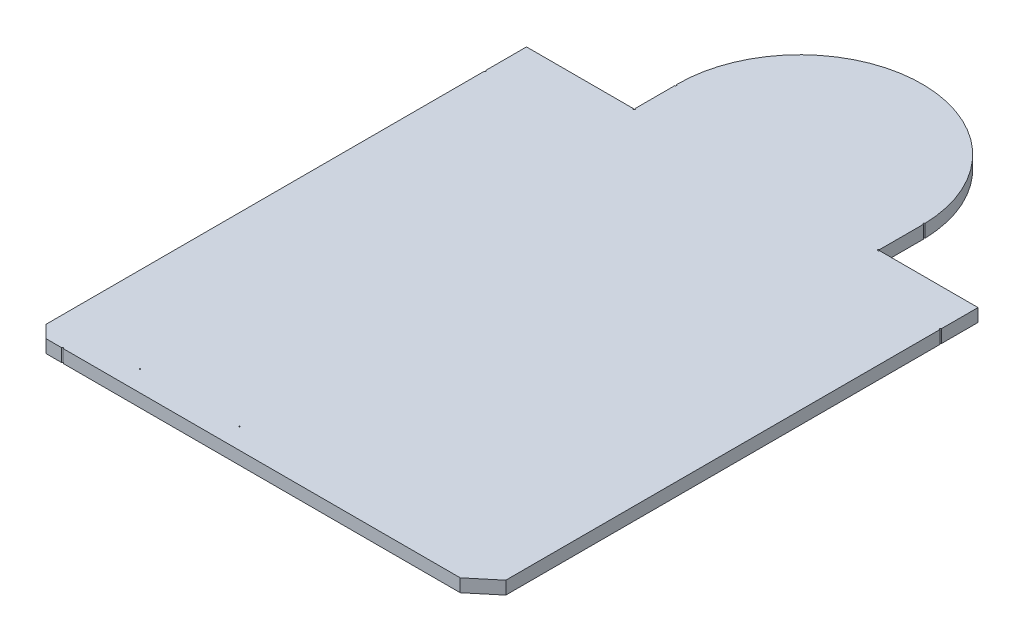
ISO-10303-21;
HEADER;
FILE_DESCRIPTION(('STEP AP214'),'2;1');
FILE_NAME('part.step','',(''),(''),'','','');
FILE_SCHEMA(('AUTOMOTIVE_DESIGN { 1 0 10303 214 1 1 1 1 }'));
ENDSEC;
DATA;
#1=APPLICATION_CONTEXT('core data for automotive mechanical design processes');
#2=APPLICATION_PROTOCOL_DEFINITION('international standard','automotive_design',2000,#1);
#3=PRODUCT_CONTEXT('',#1,'mechanical');
#4=PRODUCT('Part','Part','',(#3));
#5=PRODUCT_RELATED_PRODUCT_CATEGORY('part','',(#4));
#6=PRODUCT_DEFINITION_FORMATION('','',#4);
#7=PRODUCT_DEFINITION_CONTEXT('part definition',#1,'design');
#8=PRODUCT_DEFINITION('design','',#6,#7);
#9=PRODUCT_DEFINITION_SHAPE('','',#8);
#10=(LENGTH_UNIT() NAMED_UNIT(*) SI_UNIT(.MILLI.,.METRE.));
#11=(NAMED_UNIT(*) PLANE_ANGLE_UNIT() SI_UNIT($,.RADIAN.));
#12=(NAMED_UNIT(*) SI_UNIT($,.STERADIAN.) SOLID_ANGLE_UNIT());
#13=UNCERTAINTY_MEASURE_WITH_UNIT(LENGTH_MEASURE(1.E-05),#10,'distance_accuracy_value','');
#14=(GEOMETRIC_REPRESENTATION_CONTEXT(3) GLOBAL_UNCERTAINTY_ASSIGNED_CONTEXT((#13)) GLOBAL_UNIT_ASSIGNED_CONTEXT((#10,
#11,#12)) REPRESENTATION_CONTEXT('',''));
#15=CARTESIAN_POINT('',(0.,0.,0.));
#16=DIRECTION('',(0.,0.,1.));
#17=DIRECTION('',(1.,0.,0.));
#18=AXIS2_PLACEMENT_3D('',#15,#16,#17);
#19=CARTESIAN_POINT('',(0.,32.1267390401011,95.8248615599991));
#20=DIRECTION('',(0.,0.,1.));
#21=DIRECTION('',(1.,0.,0.));
#22=AXIS2_PLACEMENT_3D('',#19,#20,#21);
#23=PLANE('',#22);
#24=DIRECTION('',(-1.,0.,0.));
#25=VECTOR('',#24,1.);
#26=CARTESIAN_POINT('',(0.,30.5392390401011,95.8248615599991));
#27=LINE('',#26,#25);
#28=CARTESIAN_POINT('',(43.7550241698272,30.5392390401011,95.8248615599991));
#29=VERTEX_POINT('',#28);
#30=CARTESIAN_POINT('',(-4.91137583017276,30.5392390401011,95.8248615599991));
#31=VERTEX_POINT('',#30);
#32=EDGE_CURVE('E214',#29,#31,#27,.T.);
#33=ORIENTED_EDGE('',*,*,#32,.F.);
#34=DIRECTION('',(0.,-1.,0.));
#35=VECTOR('',#34,1.);
#36=CARTESIAN_POINT('',(43.7550241698272,32.1267390401011,95.8248615599991));
#37=LINE('',#36,#35);
#38=CARTESIAN_POINT('',(43.7550241698272,32.1267390401011,95.8248615599991));
#39=VERTEX_POINT('',#38);
#40=EDGE_CURVE('E11',#39,#29,#37,.T.);
#41=ORIENTED_EDGE('',*,*,#40,.F.);
#42=DIRECTION('',(-1.,0.,0.));
#43=VECTOR('',#42,1.);
#44=CARTESIAN_POINT('',(0.,32.1267390401011,95.8248615599991));
#45=LINE('',#44,#43);
#46=CARTESIAN_POINT('',(-4.91137583017276,32.1267390401011,95.8248615599991));
#47=VERTEX_POINT('',#46);
#48=EDGE_CURVE('E335',#39,#47,#45,.T.);
#49=ORIENTED_EDGE('',*,*,#48,.T.);
#50=DIRECTION('',(0.,-1.,0.));
#51=VECTOR('',#50,1.);
#52=CARTESIAN_POINT('',(-4.91137583017276,32.1267390401011,95.8248615599991));
#53=LINE('',#52,#51);
#54=EDGE_CURVE('E53',#47,#31,#53,.T.);
#55=ORIENTED_EDGE('',*,*,#54,.T.);
#56=EDGE_LOOP('',(#33,#41,#49,#55));
#57=FACE_BOUND('',#56,.T.);
#58=ADVANCED_FACE('F36',(#57),#23,.T.);
#59=CARTESIAN_POINT('',(65.0593680499287,32.1267390401011,78.0712416599146));
#60=DIRECTION('',(0.640184399664479,0.,0.768221279597377));
#61=DIRECTION('',(0.768221279597377,0.,-0.640184399664479));
#62=AXIS2_PLACEMENT_3D('',#59,#60,#61);
#63=PLANE('',#62);
#64=DIRECTION('',(-0.768221279597377,0.,0.640184399664479));
#65=VECTOR('',#64,1.);
#66=CARTESIAN_POINT('',(65.0593680499287,30.5392390401011,78.0712416599146));
#67=LINE('',#66,#65);
#68=CARTESIAN_POINT('',(46.8030241698272,30.5392390401011,93.2848615599991));
#69=VERTEX_POINT('',#68);
#70=EDGE_CURVE('E216',#69,#29,#67,.T.);
#71=ORIENTED_EDGE('',*,*,#70,.F.);
#72=DIRECTION('',(0.,-1.,0.));
#73=VECTOR('',#72,1.);
#74=CARTESIAN_POINT('',(46.8030241698272,32.1267390401011,93.2848615599991));
#75=LINE('',#74,#73);
#76=CARTESIAN_POINT('',(46.8030241698272,32.1267390401011,93.2848615599991));
#77=VERTEX_POINT('',#76);
#78=EDGE_CURVE('E45',#77,#69,#75,.T.);
#79=ORIENTED_EDGE('',*,*,#78,.F.);
#80=DIRECTION('',(-0.768221279597377,0.,0.640184399664479));
#81=VECTOR('',#80,1.);
#82=CARTESIAN_POINT('',(65.0593680499287,32.1267390401011,78.0712416599146));
#83=LINE('',#82,#81);
#84=EDGE_CURVE('E327',#77,#39,#83,.T.);
#85=ORIENTED_EDGE('',*,*,#84,.T.);
#86=ORIENTED_EDGE('',*,*,#40,.T.);
#87=EDGE_LOOP('',(#71,#79,#85,#86));
#88=FACE_BOUND('',#87,.T.);
#89=ADVANCED_FACE('F314',(#88),#63,.T.);
#90=CARTESIAN_POINT('',(46.8030241698272,32.1267390401011,0.));
#91=DIRECTION('',(1.,0.,0.));
#92=DIRECTION('',(0.,0.,-1.));
#93=AXIS2_PLACEMENT_3D('',#90,#91,#92);
#94=PLANE('',#93);
#95=DIRECTION('',(0.,0.,1.));
#96=VECTOR('',#95,1.);
#97=CARTESIAN_POINT('',(46.8030241698272,30.5392390401011,0.));
#98=LINE('',#97,#96);
#99=CARTESIAN_POINT('',(46.8030241698272,30.5392390401011,40.0464615599991));
#100=VERTEX_POINT('',#99);
#101=EDGE_CURVE('E219',#100,#69,#98,.T.);
#102=ORIENTED_EDGE('',*,*,#101,.F.);
#103=DIRECTION('',(0.,-1.,0.));
#104=VECTOR('',#103,1.);
#105=CARTESIAN_POINT('',(46.8030241698272,32.1267390401011,40.0464615599991));
#106=LINE('',#105,#104);
#107=CARTESIAN_POINT('',(46.8030241698272,32.1267390401011,40.0464615599991));
#108=VERTEX_POINT('',#107);
#109=EDGE_CURVE('E303',#108,#100,#106,.T.);
#110=ORIENTED_EDGE('',*,*,#109,.F.);
#111=DIRECTION('',(0.,0.,1.));
#112=VECTOR('',#111,1.);
#113=CARTESIAN_POINT('',(46.8030241698272,32.1267390401011,0.));
#114=LINE('',#113,#112);
#115=EDGE_CURVE('E310',#108,#77,#114,.T.);
#116=ORIENTED_EDGE('',*,*,#115,.T.);
#117=ORIENTED_EDGE('',*,*,#78,.T.);
#118=EDGE_LOOP('',(#102,#110,#116,#117));
#119=FACE_BOUND('',#118,.T.);
#120=ADVANCED_FACE('F308',(#119),#94,.T.);
#121=CARTESIAN_POINT('',(46.8030241698272,32.1267390401011,39.9448615599991));
#122=DIRECTION('',(0.,-1.,0.));
#123=DIRECTION('',(0.,0.,-1.));
#124=AXIS2_PLACEMENT_3D('',#121,#122,#123);
#125=CYLINDRICAL_SURFACE('',#124,0.101599999999993);
#126=CARTESIAN_POINT('',(46.8030241698272,30.5392390401011,39.9448615599991));
#127=DIRECTION('',(0.,1.,0.));
#128=DIRECTION('',(0.,0.,1.));
#129=AXIS2_PLACEMENT_3D('',#126,#127,#128);
#130=CIRCLE('',#129,0.101599999999993);
#131=CARTESIAN_POINT('',(46.8030241698272,30.5392390401011,39.8432615599991));
#132=VERTEX_POINT('',#131);
#133=EDGE_CURVE('E222',#132,#100,#130,.T.);
#134=ORIENTED_EDGE('',*,*,#133,.F.);
#135=DIRECTION('',(0.,-1.,0.));
#136=VECTOR('',#135,1.);
#137=CARTESIAN_POINT('',(46.8030241698272,32.1267390401011,39.8432615599991));
#138=LINE('',#137,#136);
#139=CARTESIAN_POINT('',(46.8030241698272,32.1267390401011,39.8432615599991));
#140=VERTEX_POINT('',#139);
#141=EDGE_CURVE('E301',#140,#132,#138,.T.);
#142=ORIENTED_EDGE('',*,*,#141,.F.);
#143=CARTESIAN_POINT('',(46.8030241698272,32.1267390401011,39.9448615599991));
#144=DIRECTION('',(0.,1.,0.));
#145=DIRECTION('',(0.,0.,1.));
#146=AXIS2_PLACEMENT_3D('',#143,#144,#145);
#147=CIRCLE('',#146,0.101599999999993);
#148=EDGE_CURVE('E324',#140,#108,#147,.T.);
#149=ORIENTED_EDGE('',*,*,#148,.T.);
#150=ORIENTED_EDGE('',*,*,#109,.T.);
#151=EDGE_LOOP('',(#134,#142,#149,#150));
#152=FACE_BOUND('',#151,.T.);
#153=ADVANCED_FACE('F321',(#152),#125,.F.);
#154=CARTESIAN_POINT('',(46.8030241698272,32.1267390401011,0.));
#155=DIRECTION('',(1.,0.,0.));
#156=DIRECTION('',(0.,0.,-1.));
#157=AXIS2_PLACEMENT_3D('',#154,#155,#156);
#158=PLANE('',#157);
#159=DIRECTION('',(0.,0.,1.));
#160=VECTOR('',#159,1.);
#161=CARTESIAN_POINT('',(46.8030241698272,30.5392390401011,0.));
#162=LINE('',#161,#160);
#163=CARTESIAN_POINT('',(46.8030241698272,30.5392390401011,35.3728615599991));
#164=VERTEX_POINT('',#163);
#165=EDGE_CURVE('E225',#164,#132,#162,.T.);
#166=ORIENTED_EDGE('',*,*,#165,.F.);
#167=DIRECTION('',(0.,-1.,0.));
#168=VECTOR('',#167,1.);
#169=CARTESIAN_POINT('',(46.8030241698272,32.1267390401011,35.3728615599991));
#170=LINE('',#169,#168);
#171=CARTESIAN_POINT('',(46.8030241698272,32.1267390401011,35.3728615599991));
#172=VERTEX_POINT('',#171);
#173=EDGE_CURVE('E299',#172,#164,#170,.T.);
#174=ORIENTED_EDGE('',*,*,#173,.F.);
#175=DIRECTION('',(0.,0.,1.));
#176=VECTOR('',#175,1.);
#177=CARTESIAN_POINT('',(46.8030241698272,32.1267390401011,0.));
#178=LINE('',#177,#176);
#179=EDGE_CURVE('E333',#172,#140,#178,.T.);
#180=ORIENTED_EDGE('',*,*,#179,.T.);
#181=ORIENTED_EDGE('',*,*,#141,.T.);
#182=EDGE_LOOP('',(#166,#174,#180,#181));
#183=FACE_BOUND('',#182,.T.);
#184=ADVANCED_FACE('F578',(#183),#158,.T.);
#185=CARTESIAN_POINT('',(0.,32.1267390401011,35.3728615599991));
#186=DIRECTION('',(0.,0.,-1.));
#187=DIRECTION('',(-1.,0.,0.));
#188=AXIS2_PLACEMENT_3D('',#185,#186,#187);
#189=PLANE('',#188);
#190=DIRECTION('',(1.,0.,0.));
#191=VECTOR('',#190,1.);
#192=CARTESIAN_POINT('',(0.,30.5392390401011,35.3728615599991));
#193=LINE('',#192,#191);
#194=CARTESIAN_POINT('',(34.7126241698273,30.5392390401011,35.3728615599991));
#195=VERTEX_POINT('',#194);
#196=EDGE_CURVE('E228',#195,#164,#193,.T.);
#197=ORIENTED_EDGE('',*,*,#196,.F.);
#198=DIRECTION('',(0.,-1.,0.));
#199=VECTOR('',#198,1.);
#200=CARTESIAN_POINT('',(34.7126241698273,32.1267390401011,35.3728615599991));
#201=LINE('',#200,#199);
#202=CARTESIAN_POINT('',(34.7126241698273,32.1267390401011,35.3728615599991));
#203=VERTEX_POINT('',#202);
#204=EDGE_CURVE('E297',#203,#195,#201,.T.);
#205=ORIENTED_EDGE('',*,*,#204,.F.);
#206=DIRECTION('',(1.,0.,0.));
#207=VECTOR('',#206,1.);
#208=CARTESIAN_POINT('',(0.,32.1267390401011,35.3728615599991));
#209=LINE('',#208,#207);
#210=EDGE_CURVE('E341',#203,#172,#209,.T.);
#211=ORIENTED_EDGE('',*,*,#210,.T.);
#212=ORIENTED_EDGE('',*,*,#173,.T.);
#213=EDGE_LOOP('',(#197,#205,#211,#212));
#214=FACE_BOUND('',#213,.T.);
#215=ADVANCED_FACE('F567',(#214),#189,.T.);
#216=CARTESIAN_POINT('',(34.6110241698273,32.1267390401011,35.3728615599991));
#217=DIRECTION('',(0.,-1.,0.));
#218=DIRECTION('',(0.,0.,-1.));
#219=AXIS2_PLACEMENT_3D('',#216,#217,#218);
#220=CYLINDRICAL_SURFACE('',#219,0.1016);
#221=CARTESIAN_POINT('',(34.6110241698273,30.5392390401011,35.3728615599991));
#222=DIRECTION('',(0.,1.,0.));
#223=DIRECTION('',(0.,0.,1.));
#224=AXIS2_PLACEMENT_3D('',#221,#222,#223);
#225=CIRCLE('',#224,0.1016);
#226=CARTESIAN_POINT('',(34.6110241698273,30.5392390401011,35.2712615599991));
#227=VERTEX_POINT('',#226);
#228=EDGE_CURVE('E231',#227,#195,#225,.T.);
#229=ORIENTED_EDGE('',*,*,#228,.F.);
#230=DIRECTION('',(0.,-1.,0.));
#231=VECTOR('',#230,1.);
#232=CARTESIAN_POINT('',(34.6110241698273,32.1267390401011,35.2712615599991));
#233=LINE('',#232,#231);
#234=CARTESIAN_POINT('',(34.6110241698273,32.1267390401011,35.2712615599991));
#235=VERTEX_POINT('',#234);
#236=EDGE_CURVE('E295',#235,#227,#233,.T.);
#237=ORIENTED_EDGE('',*,*,#236,.F.);
#238=CARTESIAN_POINT('',(34.6110241698273,32.1267390401011,35.3728615599991));
#239=DIRECTION('',(0.,1.,0.));
#240=DIRECTION('',(0.,0.,1.));
#241=AXIS2_PLACEMENT_3D('',#238,#239,#240);
#242=CIRCLE('',#241,0.1016);
#243=EDGE_CURVE('E345',#235,#203,#242,.T.);
#244=ORIENTED_EDGE('',*,*,#243,.T.);
#245=ORIENTED_EDGE('',*,*,#204,.T.);
#246=EDGE_LOOP('',(#229,#237,#244,#245));
#247=FACE_BOUND('',#246,.T.);
#248=ADVANCED_FACE('F557',(#247),#220,.F.);
#249=CARTESIAN_POINT('',(34.6110241698273,32.1267390401011,0.));
#250=DIRECTION('',(-1.,0.,0.));
#251=DIRECTION('',(0.,0.,1.));
#252=AXIS2_PLACEMENT_3D('',#249,#250,#251);
#253=PLANE('',#252);
#254=DIRECTION('',(0.,0.,-1.));
#255=VECTOR('',#254,1.);
#256=CARTESIAN_POINT('',(34.6110241698273,30.5392390401011,0.));
#257=LINE('',#256,#255);
#258=CARTESIAN_POINT('',(34.6110241698273,30.5392390401011,29.8855889298978));
#259=VERTEX_POINT('',#258);
#260=EDGE_CURVE('E234',#227,#259,#257,.T.);
#261=ORIENTED_EDGE('',*,*,#260,.T.);
#262=DIRECTION('',(0.,-1.,0.));
#263=VECTOR('',#262,1.);
#264=CARTESIAN_POINT('',(34.6110241698273,32.1267390401011,29.8855889298978));
#265=LINE('',#264,#263);
#266=CARTESIAN_POINT('',(34.6110241698273,32.1267390401011,29.8855889298978));
#267=VERTEX_POINT('',#266);
#268=EDGE_CURVE('E293',#267,#259,#265,.T.);
#269=ORIENTED_EDGE('',*,*,#268,.F.);
#270=DIRECTION('',(0.,0.,-1.));
#271=VECTOR('',#270,1.);
#272=CARTESIAN_POINT('',(34.6110241698273,32.1267390401011,0.));
#273=LINE('',#272,#271);
#274=EDGE_CURVE('E349',#235,#267,#273,.T.);
#275=ORIENTED_EDGE('',*,*,#274,.F.);
#276=ORIENTED_EDGE('',*,*,#236,.T.);
#277=EDGE_LOOP('',(#261,#269,#275,#276));
#278=FACE_BOUND('',#277,.T.);
#279=ADVANCED_FACE('F546',(#278),#253,.F.);
#280=CARTESIAN_POINT('',(34.6110114698272,32.1267390401011,29.7839979599991));
#281=DIRECTION('',(0.,-1.,0.));
#282=DIRECTION('',(0.,0.,-1.));
#283=AXIS2_PLACEMENT_3D('',#280,#281,#282);
#284=CYLINDRICAL_SURFACE('',#283,0.101590970692525);
#285=CARTESIAN_POINT('',(34.6110114698272,30.5392390401011,29.7839979599991));
#286=DIRECTION('',(0.,1.,0.));
#287=DIRECTION('',(0.,0.,1.));
#288=AXIS2_PLACEMENT_3D('',#285,#286,#287);
#289=CIRCLE('',#288,0.101590970692525);
#290=CARTESIAN_POINT('',(34.6089377850433,30.5392390401011,29.6824281556394));
#291=VERTEX_POINT('',#290);
#292=EDGE_CURVE('E237',#291,#259,#289,.T.);
#293=ORIENTED_EDGE('',*,*,#292,.F.);
#294=DIRECTION('',(0.,-1.,0.));
#295=VECTOR('',#294,1.);
#296=CARTESIAN_POINT('',(34.6089377850433,32.1267390401011,29.6824281556394));
#297=LINE('',#296,#295);
#298=CARTESIAN_POINT('',(34.6089377850433,32.1267390401011,29.6824281556394));
#299=VERTEX_POINT('',#298);
#300=EDGE_CURVE('E291',#299,#291,#297,.T.);
#301=ORIENTED_EDGE('',*,*,#300,.F.);
#302=CARTESIAN_POINT('',(34.6110114698272,32.1267390401011,29.7839979599991));
#303=DIRECTION('',(0.,1.,0.));
#304=DIRECTION('',(0.,0.,1.));
#305=AXIS2_PLACEMENT_3D('',#302,#303,#304);
#306=CIRCLE('',#305,0.101590970692525);
#307=EDGE_CURVE('E352',#299,#267,#306,.T.);
#308=ORIENTED_EDGE('',*,*,#307,.T.);
#309=ORIENTED_EDGE('',*,*,#268,.T.);
#310=EDGE_LOOP('',(#293,#301,#308,#309));
#311=FACE_BOUND('',#310,.T.);
#312=ADVANCED_FACE('F536',(#311),#284,.F.);
#313=CARTESIAN_POINT('',(19.6250241698273,32.1267390401011,30.0388615599991));
#314=DIRECTION('',(0.,-1.,0.));
#315=DIRECTION('',(0.,0.,-1.));
#316=AXIS2_PLACEMENT_3D('',#313,#314,#315);
#317=CYLINDRICAL_SURFACE('',#316,14.9881523878028);
#318=CARTESIAN_POINT('',(19.6250241698273,30.5392390401011,30.0388615599991));
#319=DIRECTION('',(0.,1.,0.));
#320=DIRECTION('',(0.,0.,1.));
#321=AXIS2_PLACEMENT_3D('',#318,#319,#320);
#322=CIRCLE('',#321,14.9881523878028);
#323=CARTESIAN_POINT('',(4.63763803452099,30.5392390401011,30.1904162736491));
#324=VERTEX_POINT('',#323);
#325=EDGE_CURVE('E240',#291,#324,#322,.T.);
#326=ORIENTED_EDGE('',*,*,#325,.T.);
#327=DIRECTION('',(0.,-1.,0.));
#328=VECTOR('',#327,1.);
#329=CARTESIAN_POINT('',(4.63763803452099,32.1267390401011,30.1904162736491));
#330=LINE('',#329,#328);
#331=CARTESIAN_POINT('',(4.63763803452099,32.1267390401011,30.1904162736491));
#332=VERTEX_POINT('',#331);
#333=EDGE_CURVE('E289',#332,#324,#330,.T.);
#334=ORIENTED_EDGE('',*,*,#333,.F.);
#335=CARTESIAN_POINT('',(19.6250241698273,32.1267390401011,30.0388615599991));
#336=DIRECTION('',(0.,1.,0.));
#337=DIRECTION('',(0.,0.,1.));
#338=AXIS2_PLACEMENT_3D('',#335,#336,#337);
#339=CIRCLE('',#338,14.9881523878028);
#340=EDGE_CURVE('E356',#299,#332,#339,.T.);
#341=ORIENTED_EDGE('',*,*,#340,.F.);
#342=ORIENTED_EDGE('',*,*,#300,.T.);
#343=EDGE_LOOP('',(#326,#334,#341,#342));
#344=FACE_BOUND('',#343,.T.);
#345=ADVANCED_FACE('F525',(#344),#317,.T.);
#346=CARTESIAN_POINT('',(4.63901146982724,32.1267390401011,30.2919979599991));
#347=DIRECTION('',(0.,-1.,0.));
#348=DIRECTION('',(0.,0.,-1.));
#349=AXIS2_PLACEMENT_3D('',#346,#347,#348);
#350=CYLINDRICAL_SURFACE('',#349,0.101590970692525);
#351=CARTESIAN_POINT('',(4.63901146982724,30.5392390401011,30.2919979599991));
#352=DIRECTION('',(0.,1.,0.));
#353=DIRECTION('',(0.,0.,1.));
#354=AXIS2_PLACEMENT_3D('',#351,#352,#353);
#355=CIRCLE('',#354,0.101590970692525);
#356=CARTESIAN_POINT('',(4.63902416982726,30.5392390401011,30.3935889298978));
#357=VERTEX_POINT('',#356);
#358=EDGE_CURVE('E243',#357,#324,#355,.T.);
#359=ORIENTED_EDGE('',*,*,#358,.F.);
#360=DIRECTION('',(0.,-1.,0.));
#361=VECTOR('',#360,1.);
#362=CARTESIAN_POINT('',(4.63902416982726,32.1267390401011,30.3935889298978));
#363=LINE('',#362,#361);
#364=CARTESIAN_POINT('',(4.63902416982726,32.1267390401011,30.3935889298978));
#365=VERTEX_POINT('',#364);
#366=EDGE_CURVE('E287',#365,#357,#363,.T.);
#367=ORIENTED_EDGE('',*,*,#366,.F.);
#368=CARTESIAN_POINT('',(4.63901146982724,32.1267390401011,30.2919979599991));
#369=DIRECTION('',(0.,1.,0.));
#370=DIRECTION('',(0.,0.,1.));
#371=AXIS2_PLACEMENT_3D('',#368,#369,#370);
#372=CIRCLE('',#371,0.101590970692525);
#373=EDGE_CURVE('E359',#365,#332,#372,.T.);
#374=ORIENTED_EDGE('',*,*,#373,.T.);
#375=ORIENTED_EDGE('',*,*,#333,.T.);
#376=EDGE_LOOP('',(#359,#367,#374,#375));
#377=FACE_BOUND('',#376,.T.);
#378=ADVANCED_FACE('F515',(#377),#350,.F.);
#379=CARTESIAN_POINT('',(4.63902416982726,32.1267390401011,0.));
#380=DIRECTION('',(-1.,0.,0.));
#381=DIRECTION('',(0.,0.,1.));
#382=AXIS2_PLACEMENT_3D('',#379,#380,#381);
#383=PLANE('',#382);
#384=DIRECTION('',(0.,0.,-1.));
#385=VECTOR('',#384,1.);
#386=CARTESIAN_POINT('',(4.63902416982726,30.5392390401011,0.));
#387=LINE('',#386,#385);
#388=CARTESIAN_POINT('',(4.63902416982726,30.5392390401011,35.2712615599991));
#389=VERTEX_POINT('',#388);
#390=EDGE_CURVE('E246',#389,#357,#387,.T.);
#391=ORIENTED_EDGE('',*,*,#390,.F.);
#392=DIRECTION('',(0.,-1.,0.));
#393=VECTOR('',#392,1.);
#394=CARTESIAN_POINT('',(4.63902416982726,32.1267390401011,35.2712615599991));
#395=LINE('',#394,#393);
#396=CARTESIAN_POINT('',(4.63902416982726,32.1267390401011,35.2712615599991));
#397=VERTEX_POINT('',#396);
#398=EDGE_CURVE('E285',#397,#389,#395,.T.);
#399=ORIENTED_EDGE('',*,*,#398,.F.);
#400=DIRECTION('',(0.,0.,-1.));
#401=VECTOR('',#400,1.);
#402=CARTESIAN_POINT('',(4.63902416982726,32.1267390401011,0.));
#403=LINE('',#402,#401);
#404=EDGE_CURVE('E363',#397,#365,#403,.T.);
#405=ORIENTED_EDGE('',*,*,#404,.T.);
#406=ORIENTED_EDGE('',*,*,#366,.T.);
#407=EDGE_LOOP('',(#391,#399,#405,#406));
#408=FACE_BOUND('',#407,.T.);
#409=ADVANCED_FACE('F504',(#408),#383,.T.);
#410=CARTESIAN_POINT('',(4.63902416982726,32.1267390401011,35.3728615599991));
#411=DIRECTION('',(0.,-1.,0.));
#412=DIRECTION('',(0.,0.,-1.));
#413=AXIS2_PLACEMENT_3D('',#410,#411,#412);
#414=CYLINDRICAL_SURFACE('',#413,0.101600000000007);
#415=CARTESIAN_POINT('',(4.63902416982726,30.5392390401011,35.3728615599991));
#416=DIRECTION('',(0.,1.,0.));
#417=DIRECTION('',(0.,0.,1.));
#418=AXIS2_PLACEMENT_3D('',#415,#416,#417);
#419=CIRCLE('',#418,0.101600000000007);
#420=CARTESIAN_POINT('',(4.53742416982726,30.5392390401011,35.3728615599991));
#421=VERTEX_POINT('',#420);
#422=EDGE_CURVE('E249',#421,#389,#419,.T.);
#423=ORIENTED_EDGE('',*,*,#422,.F.);
#424=DIRECTION('',(0.,-1.,0.));
#425=VECTOR('',#424,1.);
#426=CARTESIAN_POINT('',(4.53742416982726,32.1267390401011,35.3728615599991));
#427=LINE('',#426,#425);
#428=CARTESIAN_POINT('',(4.53742416982726,32.1267390401011,35.3728615599991));
#429=VERTEX_POINT('',#428);
#430=EDGE_CURVE('E283',#429,#421,#427,.T.);
#431=ORIENTED_EDGE('',*,*,#430,.F.);
#432=CARTESIAN_POINT('',(4.63902416982726,32.1267390401011,35.3728615599991));
#433=DIRECTION('',(0.,1.,0.));
#434=DIRECTION('',(0.,0.,1.));
#435=AXIS2_PLACEMENT_3D('',#432,#433,#434);
#436=CIRCLE('',#435,0.101600000000007);
#437=EDGE_CURVE('E367',#429,#397,#436,.T.);
#438=ORIENTED_EDGE('',*,*,#437,.T.);
#439=ORIENTED_EDGE('',*,*,#398,.T.);
#440=EDGE_LOOP('',(#423,#431,#438,#439));
#441=FACE_BOUND('',#440,.T.);
#442=ADVANCED_FACE('F494',(#441),#414,.F.);
#443=CARTESIAN_POINT('',(0.,32.1267390401011,35.3728615599991));
#444=DIRECTION('',(0.,0.,-1.));
#445=DIRECTION('',(-1.,0.,0.));
#446=AXIS2_PLACEMENT_3D('',#443,#444,#445);
#447=PLANE('',#446);
#448=DIRECTION('',(1.,0.,0.));
#449=VECTOR('',#448,1.);
#450=CARTESIAN_POINT('',(0.,30.5392390401011,35.3728615599991));
#451=LINE('',#450,#449);
#452=CARTESIAN_POINT('',(-8.56897583017274,30.5392390401011,35.3728615599991));
#453=VERTEX_POINT('',#452);
#454=EDGE_CURVE('E252',#453,#421,#451,.T.);
#455=ORIENTED_EDGE('',*,*,#454,.F.);
#456=DIRECTION('',(0.,-1.,0.));
#457=VECTOR('',#456,1.);
#458=CARTESIAN_POINT('',(-8.56897583017274,32.1267390401011,35.3728615599991));
#459=LINE('',#458,#457);
#460=CARTESIAN_POINT('',(-8.56897583017274,32.1267390401011,35.3728615599991));
#461=VERTEX_POINT('',#460);
#462=EDGE_CURVE('E281',#461,#453,#459,.T.);
#463=ORIENTED_EDGE('',*,*,#462,.F.);
#464=DIRECTION('',(1.,0.,0.));
#465=VECTOR('',#464,1.);
#466=CARTESIAN_POINT('',(0.,32.1267390401011,35.3728615599991));
#467=LINE('',#466,#465);
#468=EDGE_CURVE('E371',#461,#429,#467,.T.);
#469=ORIENTED_EDGE('',*,*,#468,.T.);
#470=ORIENTED_EDGE('',*,*,#430,.T.);
#471=EDGE_LOOP('',(#455,#463,#469,#470));
#472=FACE_BOUND('',#471,.T.);
#473=ADVANCED_FACE('F484',(#472),#447,.T.);
#474=CARTESIAN_POINT('',(-8.56897583017274,32.1267390401011,0.));
#475=DIRECTION('',(-1.,0.,0.));
#476=DIRECTION('',(0.,0.,1.));
#477=AXIS2_PLACEMENT_3D('',#474,#475,#476);
#478=PLANE('',#477);
#479=DIRECTION('',(0.,0.,-1.));
#480=VECTOR('',#479,1.);
#481=CARTESIAN_POINT('',(-8.56897583017274,30.5392390401011,0.));
#482=LINE('',#481,#480);
#483=CARTESIAN_POINT('',(-8.56897583017274,30.5392390401011,40.3512615599991));
#484=VERTEX_POINT('',#483);
#485=EDGE_CURVE('E255',#484,#453,#482,.T.);
#486=ORIENTED_EDGE('',*,*,#485,.F.);
#487=DIRECTION('',(0.,-1.,0.));
#488=VECTOR('',#487,1.);
#489=CARTESIAN_POINT('',(-8.56897583017274,32.1267390401011,40.3512615599991));
#490=LINE('',#489,#488);
#491=CARTESIAN_POINT('',(-8.56897583017274,32.1267390401011,40.3512615599991));
#492=VERTEX_POINT('',#491);
#493=EDGE_CURVE('E279',#492,#484,#490,.T.);
#494=ORIENTED_EDGE('',*,*,#493,.F.);
#495=DIRECTION('',(0.,0.,-1.));
#496=VECTOR('',#495,1.);
#497=CARTESIAN_POINT('',(-8.56897583017274,32.1267390401011,0.));
#498=LINE('',#497,#496);
#499=EDGE_CURVE('E375',#492,#461,#498,.T.);
#500=ORIENTED_EDGE('',*,*,#499,.T.);
#501=ORIENTED_EDGE('',*,*,#462,.T.);
#502=EDGE_LOOP('',(#486,#494,#500,#501));
#503=FACE_BOUND('',#502,.T.);
#504=ADVANCED_FACE('F473',(#503),#478,.T.);
#505=CARTESIAN_POINT('',(-8.56897583017274,32.1267390401011,40.4528615599991));
#506=DIRECTION('',(0.,-1.,0.));
#507=DIRECTION('',(0.,0.,-1.));
#508=AXIS2_PLACEMENT_3D('',#505,#506,#507);
#509=CYLINDRICAL_SURFACE('',#508,0.1016);
#510=CARTESIAN_POINT('',(-8.56897583017274,30.5392390401011,40.4528615599991));
#511=DIRECTION('',(0.,1.,0.));
#512=DIRECTION('',(0.,0.,1.));
#513=AXIS2_PLACEMENT_3D('',#510,#511,#512);
#514=CIRCLE('',#513,0.1016);
#515=CARTESIAN_POINT('',(-8.56897583017274,30.5392390401011,40.5544615599991));
#516=VERTEX_POINT('',#515);
#517=EDGE_CURVE('E258',#516,#484,#514,.T.);
#518=ORIENTED_EDGE('',*,*,#517,.F.);
#519=DIRECTION('',(0.,-1.,0.));
#520=VECTOR('',#519,1.);
#521=CARTESIAN_POINT('',(-8.56897583017274,32.1267390401011,40.5544615599991));
#522=LINE('',#521,#520);
#523=CARTESIAN_POINT('',(-8.56897583017274,32.1267390401011,40.5544615599991));
#524=VERTEX_POINT('',#523);
#525=EDGE_CURVE('E277',#524,#516,#522,.T.);
#526=ORIENTED_EDGE('',*,*,#525,.F.);
#527=CARTESIAN_POINT('',(-8.56897583017274,32.1267390401011,40.4528615599991));
#528=DIRECTION('',(0.,1.,0.));
#529=DIRECTION('',(0.,0.,1.));
#530=AXIS2_PLACEMENT_3D('',#527,#528,#529);
#531=CIRCLE('',#530,0.1016);
#532=EDGE_CURVE('E379',#524,#492,#531,.T.);
#533=ORIENTED_EDGE('',*,*,#532,.T.);
#534=ORIENTED_EDGE('',*,*,#493,.T.);
#535=EDGE_LOOP('',(#518,#526,#533,#534));
#536=FACE_BOUND('',#535,.T.);
#537=ADVANCED_FACE('F463',(#536),#509,.F.);
#538=CARTESIAN_POINT('',(-8.56897583017274,32.1267390401011,0.));
#539=DIRECTION('',(1.,0.,0.));
#540=DIRECTION('',(0.,0.,-1.));
#541=AXIS2_PLACEMENT_3D('',#538,#539,#540);
#542=PLANE('',#541);
#543=DIRECTION('',(0.,0.,1.));
#544=VECTOR('',#543,1.);
#545=CARTESIAN_POINT('',(-8.56897583017274,30.5392390401011,0.));
#546=LINE('',#545,#544);
#547=CARTESIAN_POINT('',(-8.56897583017274,30.5392390401011,94.3008615599991));
#548=VERTEX_POINT('',#547);
#549=EDGE_CURVE('E261',#516,#548,#546,.T.);
#550=ORIENTED_EDGE('',*,*,#549,.T.);
#551=DIRECTION('',(0.,-1.,0.));
#552=VECTOR('',#551,1.);
#553=CARTESIAN_POINT('',(-8.56897583017274,32.1267390401011,94.3008615599991));
#554=LINE('',#553,#552);
#555=CARTESIAN_POINT('',(-8.56897583017274,32.1267390401011,94.3008615599991));
#556=VERTEX_POINT('',#555);
#557=EDGE_CURVE('E184',#556,#548,#554,.T.);
#558=ORIENTED_EDGE('',*,*,#557,.F.);
#559=DIRECTION('',(0.,0.,1.));
#560=VECTOR('',#559,1.);
#561=CARTESIAN_POINT('',(-8.56897583017274,32.1267390401011,0.));
#562=LINE('',#561,#560);
#563=EDGE_CURVE('E194',#524,#556,#562,.T.);
#564=ORIENTED_EDGE('',*,*,#563,.F.);
#565=ORIENTED_EDGE('',*,*,#525,.T.);
#566=EDGE_LOOP('',(#550,#558,#564,#565));
#567=FACE_BOUND('',#566,.T.);
#568=ADVANCED_FACE('F453',(#567),#542,.F.);
#569=CARTESIAN_POINT('',(-51.4349186950859,32.1267390401011,51.4349186950859));
#570=DIRECTION('',(-0.707106781186548,0.,0.707106781186548));
#571=DIRECTION('',(0.707106781186548,0.,0.707106781186548));
#572=AXIS2_PLACEMENT_3D('',#569,#570,#571);
#573=PLANE('',#572);
#574=DIRECTION('',(-0.707106781186548,0.,-0.707106781186548));
#575=VECTOR('',#574,1.);
#576=CARTESIAN_POINT('',(-51.4349186950859,30.5392390401011,51.4349186950859));
#577=LINE('',#576,#575);
#578=CARTESIAN_POINT('',(-7.04497583017274,30.5392390401011,95.8248615599991));
#579=VERTEX_POINT('',#578);
#580=EDGE_CURVE('E180',#579,#548,#577,.T.);
#581=ORIENTED_EDGE('',*,*,#580,.F.);
#582=DIRECTION('',(0.,-1.,0.));
#583=VECTOR('',#582,1.);
#584=CARTESIAN_POINT('',(-7.04497583017274,32.1267390401011,95.8248615599991));
#585=LINE('',#584,#583);
#586=CARTESIAN_POINT('',(-7.04497583017274,32.1267390401011,95.8248615599991));
#587=VERTEX_POINT('',#586);
#588=EDGE_CURVE('E175',#587,#579,#585,.T.);
#589=ORIENTED_EDGE('',*,*,#588,.F.);
#590=DIRECTION('',(-0.707106781186548,0.,-0.707106781186548));
#591=VECTOR('',#590,1.);
#592=CARTESIAN_POINT('',(-51.4349186950859,32.1267390401011,51.4349186950859));
#593=LINE('',#592,#591);
#594=EDGE_CURVE('E178',#587,#556,#593,.T.);
#595=ORIENTED_EDGE('',*,*,#594,.T.);
#596=ORIENTED_EDGE('',*,*,#557,.T.);
#597=EDGE_LOOP('',(#581,#589,#595,#596));
#598=FACE_BOUND('',#597,.T.);
#599=ADVANCED_FACE('F177',(#598),#573,.T.);
#600=CARTESIAN_POINT('',(0.,32.1267390401011,95.8248615599991));
#601=DIRECTION('',(0.,0.,1.));
#602=DIRECTION('',(1.,0.,0.));
#603=AXIS2_PLACEMENT_3D('',#600,#601,#602);
#604=PLANE('',#603);
#605=DIRECTION('',(-1.,0.,0.));
#606=VECTOR('',#605,1.);
#607=CARTESIAN_POINT('',(0.,30.5392390401011,95.8248615599991));
#608=LINE('',#607,#606);
#609=CARTESIAN_POINT('',(-5.11457583017275,30.5392390401011,95.8248615599991));
#610=VERTEX_POINT('',#609);
#611=EDGE_CURVE('E265',#610,#579,#608,.T.);
#612=ORIENTED_EDGE('',*,*,#611,.F.);
#613=DIRECTION('',(0.,-1.,0.));
#614=VECTOR('',#613,1.);
#615=CARTESIAN_POINT('',(-5.11457583017275,32.1267390401011,95.8248615599991));
#616=LINE('',#615,#614);
#617=CARTESIAN_POINT('',(-5.11457583017275,32.1267390401011,95.8248615599991));
#618=VERTEX_POINT('',#617);
#619=EDGE_CURVE('E114',#618,#610,#616,.T.);
#620=ORIENTED_EDGE('',*,*,#619,.F.);
#621=DIRECTION('',(-1.,0.,0.));
#622=VECTOR('',#621,1.);
#623=CARTESIAN_POINT('',(0.,32.1267390401011,95.8248615599991));
#624=LINE('',#623,#622);
#625=EDGE_CURVE('E191',#618,#587,#624,.T.);
#626=ORIENTED_EDGE('',*,*,#625,.T.);
#627=ORIENTED_EDGE('',*,*,#588,.T.);
#628=EDGE_LOOP('',(#612,#620,#626,#627));
#629=FACE_BOUND('',#628,.T.);
#630=ADVANCED_FACE('F198',(#629),#604,.T.);
#631=CARTESIAN_POINT('',(-5.01297583017275,32.1267390401011,95.8248615599991));
#632=DIRECTION('',(0.,-1.,0.));
#633=DIRECTION('',(0.,0.,-1.));
#634=AXIS2_PLACEMENT_3D('',#631,#632,#633);
#635=CYLINDRICAL_SURFACE('',#634,0.101599999999993);
#636=CARTESIAN_POINT('',(-5.01297583017275,30.5392390401011,95.8248615599991));
#637=DIRECTION('',(0.,1.,0.));
#638=DIRECTION('',(0.,0.,1.));
#639=AXIS2_PLACEMENT_3D('',#636,#637,#638);
#640=CIRCLE('',#639,0.101599999999993);
#641=EDGE_CURVE('E267',#31,#610,#640,.T.);
#642=ORIENTED_EDGE('',*,*,#641,.F.);
#643=ORIENTED_EDGE('',*,*,#54,.F.);
#644=CARTESIAN_POINT('',(-5.01297583017275,32.1267390401011,95.8248615599991));
#645=DIRECTION('',(0.,1.,0.));
#646=DIRECTION('',(0.,0.,1.));
#647=AXIS2_PLACEMENT_3D('',#644,#645,#646);
#648=CIRCLE('',#647,0.101599999999993);
#649=EDGE_CURVE('E200',#47,#618,#648,.T.);
#650=ORIENTED_EDGE('',*,*,#649,.T.);
#651=ORIENTED_EDGE('',*,*,#619,.T.);
#652=EDGE_LOOP('',(#642,#643,#650,#651));
#653=FACE_BOUND('',#652,.T.);
#654=ADVANCED_FACE('F425',(#653),#635,.F.);
#655=CARTESIAN_POINT('',(1.94703056982726,32.1267390401011,93.2848615599991));
#656=DIRECTION('',(0.,-1.,0.));
#657=DIRECTION('',(0.,0.,-1.));
#658=AXIS2_PLACEMENT_3D('',#655,#656,#657);
#659=CYLINDRICAL_SURFACE('',#658,0.0634999999999941);
#660=CARTESIAN_POINT('',(1.94703056982726,32.1267390401011,93.2848615599991));
#661=DIRECTION('',(0.,1.,0.));
#662=DIRECTION('',(0.,0.,1.));
#663=AXIS2_PLACEMENT_3D('',#660,#661,#662);
#664=CIRCLE('',#663,0.0634999999999941);
#665=CARTESIAN_POINT('',(1.94703056982726,32.1267390401011,93.3483615599991));
#666=VERTEX_POINT('',#665);
#667=EDGE_CURVE('E273',#666,#666,#664,.T.);
#668=ORIENTED_EDGE('',*,*,#667,.T.);
#669=EDGE_LOOP('',(#668));
#670=FACE_BOUND('',#669,.T.);
#671=CARTESIAN_POINT('',(1.94703056982726,30.5392390401011,93.2848615599991));
#672=DIRECTION('',(0.,1.,0.));
#673=DIRECTION('',(0.,0.,1.));
#674=AXIS2_PLACEMENT_3D('',#671,#672,#673);
#675=CIRCLE('',#674,0.0634999999999941);
#676=CARTESIAN_POINT('',(1.94703056982726,30.5392390401011,93.3483615599991));
#677=VERTEX_POINT('',#676);
#678=EDGE_CURVE('E211',#677,#677,#675,.T.);
#679=ORIENTED_EDGE('',*,*,#678,.F.);
#680=EDGE_LOOP('',(#679));
#681=FACE_BOUND('',#680,.T.);
#682=ADVANCED_FACE('F38',(#670,#681),#659,.F.);
#683=CARTESIAN_POINT('',(14.1470315698272,32.1267390401011,93.2848615599991));
#684=DIRECTION('',(0.,-1.,0.));
#685=DIRECTION('',(0.,0.,-1.));
#686=AXIS2_PLACEMENT_3D('',#683,#684,#685);
#687=CYLINDRICAL_SURFACE('',#686,0.0634999999999941);
#688=CARTESIAN_POINT('',(14.1470315698272,32.1267390401011,93.2848615599991));
#689=DIRECTION('',(0.,1.,0.));
#690=DIRECTION('',(0.,0.,1.));
#691=AXIS2_PLACEMENT_3D('',#688,#689,#690);
#692=CIRCLE('',#691,0.0634999999999941);
#693=CARTESIAN_POINT('',(14.1470315698272,32.1267390401011,93.3483615599991));
#694=VERTEX_POINT('',#693);
#695=EDGE_CURVE('E205',#694,#694,#692,.T.);
#696=ORIENTED_EDGE('',*,*,#695,.T.);
#697=EDGE_LOOP('',(#696));
#698=FACE_BOUND('',#697,.T.);
#699=CARTESIAN_POINT('',(14.1470315698272,30.5392390401011,93.2848615599991));
#700=DIRECTION('',(0.,1.,0.));
#701=DIRECTION('',(0.,0.,1.));
#702=AXIS2_PLACEMENT_3D('',#699,#700,#701);
#703=CIRCLE('',#702,0.0634999999999941);
#704=CARTESIAN_POINT('',(14.1470315698272,30.5392390401011,93.3483615599991));
#705=VERTEX_POINT('',#704);
#706=EDGE_CURVE('E270',#705,#705,#703,.T.);
#707=ORIENTED_EDGE('',*,*,#706,.F.);
#708=EDGE_LOOP('',(#707));
#709=FACE_BOUND('',#708,.T.);
#710=ADVANCED_FACE('F390',(#698,#709),#687,.F.);
#711=CARTESIAN_POINT('',(0.,32.1267390401011,0.));
#712=DIRECTION('',(0.,1.,0.));
#713=DIRECTION('',(0.,0.,1.));
#714=AXIS2_PLACEMENT_3D('',#711,#712,#713);
#715=PLANE('',#714);
#716=ORIENTED_EDGE('',*,*,#667,.F.);
#717=EDGE_LOOP('',(#716));
#718=FACE_BOUND('',#717,.T.);
#719=ORIENTED_EDGE('',*,*,#48,.F.);
#720=ORIENTED_EDGE('',*,*,#84,.F.);
#721=ORIENTED_EDGE('',*,*,#115,.F.);
#722=ORIENTED_EDGE('',*,*,#148,.F.);
#723=ORIENTED_EDGE('',*,*,#179,.F.);
#724=ORIENTED_EDGE('',*,*,#210,.F.);
#725=ORIENTED_EDGE('',*,*,#243,.F.);
#726=ORIENTED_EDGE('',*,*,#274,.T.);
#727=ORIENTED_EDGE('',*,*,#307,.F.);
#728=ORIENTED_EDGE('',*,*,#340,.T.);
#729=ORIENTED_EDGE('',*,*,#373,.F.);
#730=ORIENTED_EDGE('',*,*,#404,.F.);
#731=ORIENTED_EDGE('',*,*,#437,.F.);
#732=ORIENTED_EDGE('',*,*,#468,.F.);
#733=ORIENTED_EDGE('',*,*,#499,.F.);
#734=ORIENTED_EDGE('',*,*,#532,.F.);
#735=ORIENTED_EDGE('',*,*,#563,.T.);
#736=ORIENTED_EDGE('',*,*,#594,.F.);
#737=ORIENTED_EDGE('',*,*,#625,.F.);
#738=ORIENTED_EDGE('',*,*,#649,.F.);
#739=EDGE_LOOP('',(#719,#720,#721,#722,#723,#724,#725,#726,#727,#728,#729,#730,#731,#732,#733,
#734,#735,#736,#737,#738));
#740=FACE_BOUND('',#739,.T.);
#741=ORIENTED_EDGE('',*,*,#695,.F.);
#742=EDGE_LOOP('',(#741));
#743=FACE_BOUND('',#742,.T.);
#744=ADVANCED_FACE('F188',(#718,#740,#743),#715,.T.);
#745=CARTESIAN_POINT('',(0.,30.5392390401011,0.));
#746=DIRECTION('',(0.,1.,0.));
#747=DIRECTION('',(0.,0.,1.));
#748=AXIS2_PLACEMENT_3D('',#745,#746,#747);
#749=PLANE('',#748);
#750=ORIENTED_EDGE('',*,*,#678,.T.);
#751=EDGE_LOOP('',(#750));
#752=FACE_BOUND('',#751,.T.);
#753=ORIENTED_EDGE('',*,*,#32,.T.);
#754=ORIENTED_EDGE('',*,*,#641,.T.);
#755=ORIENTED_EDGE('',*,*,#611,.T.);
#756=ORIENTED_EDGE('',*,*,#580,.T.);
#757=ORIENTED_EDGE('',*,*,#549,.F.);
#758=ORIENTED_EDGE('',*,*,#517,.T.);
#759=ORIENTED_EDGE('',*,*,#485,.T.);
#760=ORIENTED_EDGE('',*,*,#454,.T.);
#761=ORIENTED_EDGE('',*,*,#422,.T.);
#762=ORIENTED_EDGE('',*,*,#390,.T.);
#763=ORIENTED_EDGE('',*,*,#358,.T.);
#764=ORIENTED_EDGE('',*,*,#325,.F.);
#765=ORIENTED_EDGE('',*,*,#292,.T.);
#766=ORIENTED_EDGE('',*,*,#260,.F.);
#767=ORIENTED_EDGE('',*,*,#228,.T.);
#768=ORIENTED_EDGE('',*,*,#196,.T.);
#769=ORIENTED_EDGE('',*,*,#165,.T.);
#770=ORIENTED_EDGE('',*,*,#133,.T.);
#771=ORIENTED_EDGE('',*,*,#101,.T.);
#772=ORIENTED_EDGE('',*,*,#70,.T.);
#773=EDGE_LOOP('',(#753,#754,#755,#756,#757,#758,#759,#760,#761,#762,#763,#764,#765,#766,#767,
#768,#769,#770,#771,#772));
#774=FACE_BOUND('',#773,.T.);
#775=ORIENTED_EDGE('',*,*,#706,.T.);
#776=EDGE_LOOP('',(#775));
#777=FACE_BOUND('',#776,.T.);
#778=ADVANCED_FACE('F316',(#752,#774,#777),#749,.F.);
#779=CLOSED_SHELL('',(#58,#89,#120,#153,#184,#215,#248,#279,#312,#345,#378,#409,#442,#473,#504,
#537,#568,#599,#630,#654,#682,#710,#744,#778));
#780=MANIFOLD_SOLID_BREP('B2',#779);
#781=ADVANCED_BREP_SHAPE_REPRESENTATION('',(#18,#780),#14);
#782=SHAPE_DEFINITION_REPRESENTATION(#9,#781);
ENDSEC;
END-ISO-10303-21;
